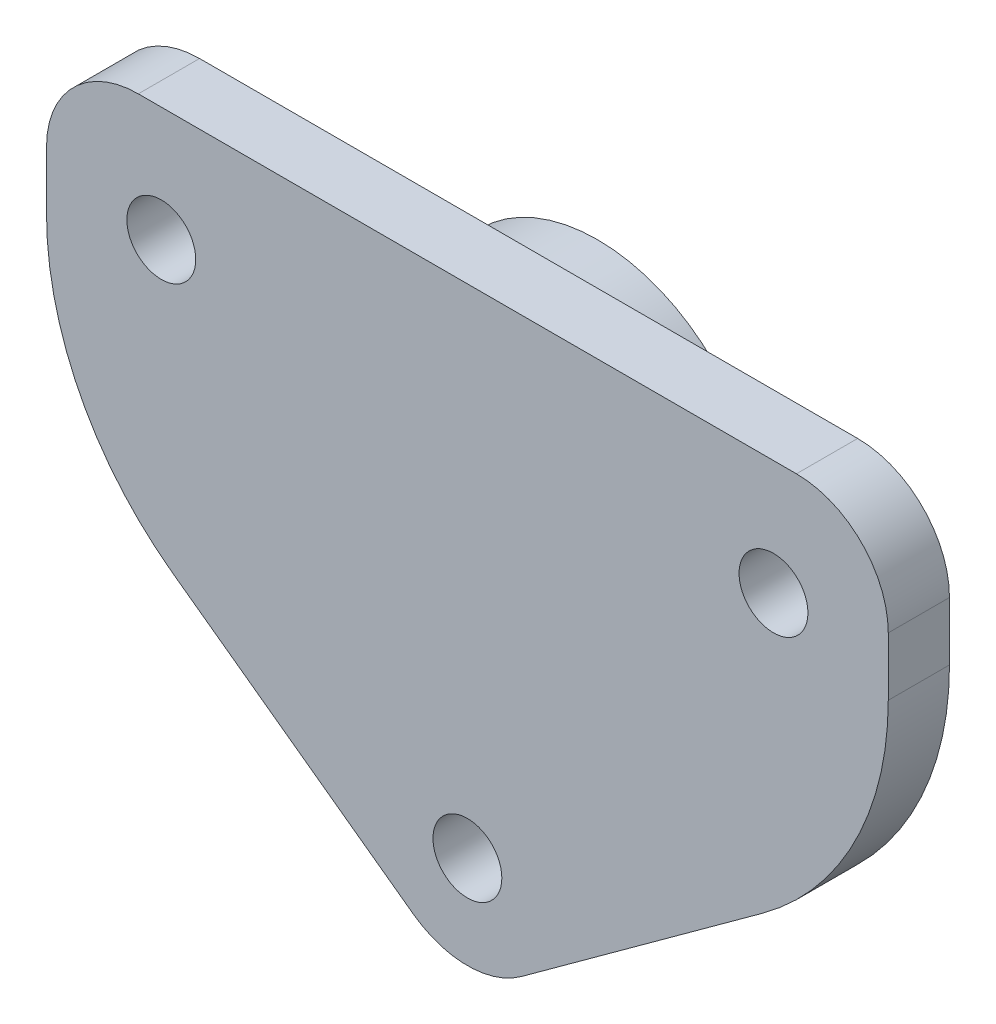
ISO-10303-21;
HEADER;
FILE_DESCRIPTION(('STEP AP214'),'2;1');
FILE_NAME('part.step','',(''),(''),'','','');
FILE_SCHEMA(('AUTOMOTIVE_DESIGN { 1 0 10303 214 1 1 1 1 }'));
ENDSEC;
DATA;
#1=APPLICATION_CONTEXT('core data for automotive mechanical design processes');
#2=APPLICATION_PROTOCOL_DEFINITION('international standard','automotive_design',2000,#1);
#3=PRODUCT_CONTEXT('',#1,'mechanical');
#4=PRODUCT('Part','Part','',(#3));
#5=PRODUCT_RELATED_PRODUCT_CATEGORY('part','',(#4));
#6=PRODUCT_DEFINITION_FORMATION('','',#4);
#7=PRODUCT_DEFINITION_CONTEXT('part definition',#1,'design');
#8=PRODUCT_DEFINITION('design','',#6,#7);
#9=PRODUCT_DEFINITION_SHAPE('','',#8);
#10=(LENGTH_UNIT() NAMED_UNIT(*) SI_UNIT(.MILLI.,.METRE.));
#11=(NAMED_UNIT(*) PLANE_ANGLE_UNIT() SI_UNIT($,.RADIAN.));
#12=(NAMED_UNIT(*) SI_UNIT($,.STERADIAN.) SOLID_ANGLE_UNIT());
#13=UNCERTAINTY_MEASURE_WITH_UNIT(LENGTH_MEASURE(1.E-05),#10,'distance_accuracy_value','');
#14=(GEOMETRIC_REPRESENTATION_CONTEXT(3) GLOBAL_UNCERTAINTY_ASSIGNED_CONTEXT((#13)) GLOBAL_UNIT_ASSIGNED_CONTEXT((#10,
#11,#12)) REPRESENTATION_CONTEXT('',''));
#15=CARTESIAN_POINT('',(0.,0.,0.));
#16=DIRECTION('',(0.,0.,1.));
#17=DIRECTION('',(1.,0.,0.));
#18=AXIS2_PLACEMENT_3D('',#15,#16,#17);
#19=CARTESIAN_POINT('',(0.,0.,4.));
#20=DIRECTION('',(0.,0.,1.));
#21=DIRECTION('',(1.,0.,0.));
#22=AXIS2_PLACEMENT_3D('',#19,#20,#21);
#23=PLANE('',#22);
#24=CARTESIAN_POINT('',(-7.5,32.5,4.));
#25=DIRECTION('',(0.,0.,1.));
#26=DIRECTION('',(1.,0.,0.));
#27=AXIS2_PLACEMENT_3D('',#24,#25,#26);
#28=CIRCLE('',#27,2.25);
#29=CARTESIAN_POINT('',(-5.25,32.5,4.));
#30=VERTEX_POINT('',#29);
#31=EDGE_CURVE('E213',#30,#30,#28,.T.);
#32=ORIENTED_EDGE('',*,*,#31,.F.);
#33=EDGE_LOOP('',(#32));
#34=FACE_BOUND('',#33,.T.);
#35=DIRECTION('',(0.,-1.,0.));
#36=VECTOR('',#35,1.);
#37=CARTESIAN_POINT('',(-55.,40.,4.));
#38=LINE('',#37,#36);
#39=CARTESIAN_POINT('',(-55.,34.,4.));
#40=VERTEX_POINT('',#39);
#41=CARTESIAN_POINT('',(-55.,30.1844918340644,4.));
#42=VERTEX_POINT('',#41);
#43=EDGE_CURVE('E144',#40,#42,#38,.T.);
#44=ORIENTED_EDGE('',*,*,#43,.T.);
#45=CARTESIAN_POINT('',(-35.,30.1844918340644,4.));
#46=DIRECTION('',(0.,0.,1.));
#47=DIRECTION('',(1.,0.,0.));
#48=AXIS2_PLACEMENT_3D('',#45,#46,#47);
#49=CIRCLE('',#48,20.);
#50=CARTESIAN_POINT('',(-46.7634339535009,14.0097701480007,4.));
#51=VERTEX_POINT('',#50);
#52=EDGE_CURVE('E176',#42,#51,#49,.T.);
#53=ORIENTED_EDGE('',*,*,#52,.T.);
#54=DIRECTION('',(0.808736084303188,-0.588171697675046,0.));
#55=VECTOR('',#54,1.);
#56=CARTESIAN_POINT('',(-55.,20.,4.));
#57=LINE('',#56,#55);
#58=CARTESIAN_POINT('',(-31.0290301860503,2.56656740803657,4.));
#59=VERTEX_POINT('',#58);
#60=EDGE_CURVE('E220',#51,#59,#57,.T.);
#61=ORIENTED_EDGE('',*,*,#60,.T.);
#62=CARTESIAN_POINT('',(-27.5,7.4189839138557,4.));
#63=DIRECTION('',(0.,0.,1.));
#64=DIRECTION('',(1.,0.,0.));
#65=AXIS2_PLACEMENT_3D('',#62,#63,#64);
#66=CIRCLE('',#65,6.);
#67=CARTESIAN_POINT('',(-23.9709698139497,2.56656740803657,4.));
#68=VERTEX_POINT('',#67);
#69=EDGE_CURVE('E154',#59,#68,#66,.T.);
#70=ORIENTED_EDGE('',*,*,#69,.T.);
#71=DIRECTION('',(0.808736084303188,0.588171697675046,0.));
#72=VECTOR('',#71,1.);
#73=CARTESIAN_POINT('',(-27.5,0.,4.));
#74=LINE('',#73,#72);
#75=CARTESIAN_POINT('',(-8.23656604649908,14.0097701480007,4.));
#76=VERTEX_POINT('',#75);
#77=EDGE_CURVE('E126',#68,#76,#74,.T.);
#78=ORIENTED_EDGE('',*,*,#77,.T.);
#79=CARTESIAN_POINT('',(-20.,30.1844918340644,4.));
#80=DIRECTION('',(0.,0.,1.));
#81=DIRECTION('',(1.,0.,0.));
#82=AXIS2_PLACEMENT_3D('',#79,#80,#81);
#83=CIRCLE('',#82,20.);
#84=CARTESIAN_POINT('',(0.,30.1844918340644,4.));
#85=VERTEX_POINT('',#84);
#86=EDGE_CURVE('E48',#76,#85,#83,.T.);
#87=ORIENTED_EDGE('',*,*,#86,.T.);
#88=DIRECTION('',(0.,1.,0.));
#89=VECTOR('',#88,1.);
#90=CARTESIAN_POINT('',(0.,40.,4.));
#91=LINE('',#90,#89);
#92=CARTESIAN_POINT('',(0.,34.,4.));
#93=VERTEX_POINT('',#92);
#94=EDGE_CURVE('E183',#85,#93,#91,.T.);
#95=ORIENTED_EDGE('',*,*,#94,.T.);
#96=CARTESIAN_POINT('',(-6.,34.,4.));
#97=DIRECTION('',(0.,0.,1.));
#98=DIRECTION('',(1.,0.,0.));
#99=AXIS2_PLACEMENT_3D('',#96,#97,#98);
#100=CIRCLE('',#99,6.);
#101=CARTESIAN_POINT('',(-6.,40.,4.));
#102=VERTEX_POINT('',#101);
#103=EDGE_CURVE('E150',#93,#102,#100,.T.);
#104=ORIENTED_EDGE('',*,*,#103,.T.);
#105=DIRECTION('',(-1.,0.,0.));
#106=VECTOR('',#105,1.);
#107=CARTESIAN_POINT('',(-55.,40.,4.));
#108=LINE('',#107,#106);
#109=CARTESIAN_POINT('',(-49.,40.,4.));
#110=VERTEX_POINT('',#109);
#111=EDGE_CURVE('E128',#102,#110,#108,.T.);
#112=ORIENTED_EDGE('',*,*,#111,.T.);
#113=CARTESIAN_POINT('',(-49.,34.,4.));
#114=DIRECTION('',(0.,0.,1.));
#115=DIRECTION('',(1.,0.,0.));
#116=AXIS2_PLACEMENT_3D('',#113,#114,#115);
#117=CIRCLE('',#116,6.);
#118=EDGE_CURVE('E152',#110,#40,#117,.T.);
#119=ORIENTED_EDGE('',*,*,#118,.T.);
#120=EDGE_LOOP('',(#44,#53,#61,#70,#78,#87,#95,#104,#112,#119));
#121=FACE_BOUND('',#120,.T.);
#122=CARTESIAN_POINT('',(-47.5,32.5,4.));
#123=DIRECTION('',(0.,0.,1.));
#124=DIRECTION('',(1.,0.,0.));
#125=AXIS2_PLACEMENT_3D('',#122,#123,#124);
#126=CIRCLE('',#125,2.25);
#127=CARTESIAN_POINT('',(-45.25,32.5,4.));
#128=VERTEX_POINT('',#127);
#129=EDGE_CURVE('E203',#128,#128,#126,.T.);
#130=ORIENTED_EDGE('',*,*,#129,.F.);
#131=EDGE_LOOP('',(#130));
#132=FACE_BOUND('',#131,.T.);
#133=CARTESIAN_POINT('',(-27.5,7.5,4.));
#134=DIRECTION('',(0.,0.,1.));
#135=DIRECTION('',(1.,0.,0.));
#136=AXIS2_PLACEMENT_3D('',#133,#134,#135);
#137=CIRCLE('',#136,2.25);
#138=CARTESIAN_POINT('',(-25.25,7.5,4.));
#139=VERTEX_POINT('',#138);
#140=EDGE_CURVE('E324',#139,#139,#137,.T.);
#141=ORIENTED_EDGE('',*,*,#140,.F.);
#142=EDGE_LOOP('',(#141));
#143=FACE_BOUND('',#142,.T.);
#144=ADVANCED_FACE('F33',(#34,#121,#132,#143),#23,.T.);
#145=CARTESIAN_POINT('',(0.,0.,0.));
#146=DIRECTION('',(0.,0.,1.));
#147=DIRECTION('',(1.,0.,0.));
#148=AXIS2_PLACEMENT_3D('',#145,#146,#147);
#149=PLANE('',#148);
#150=CARTESIAN_POINT('',(-27.5,27.5,0.));
#151=DIRECTION('',(0.,0.,1.));
#152=DIRECTION('',(1.,0.,0.));
#153=AXIS2_PLACEMENT_3D('',#150,#151,#152);
#154=CIRCLE('',#153,10.75);
#155=CARTESIAN_POINT('',(-16.75,27.5,0.));
#156=VERTEX_POINT('',#155);
#157=EDGE_CURVE('E11',#156,#156,#154,.F.);
#158=ORIENTED_EDGE('',*,*,#157,.F.);
#159=EDGE_LOOP('',(#158));
#160=FACE_BOUND('',#159,.T.);
#161=DIRECTION('',(0.808736084303188,-0.588171697675046,0.));
#162=VECTOR('',#161,1.);
#163=CARTESIAN_POINT('',(-55.,20.,0.));
#164=LINE('',#163,#162);
#165=CARTESIAN_POINT('',(-46.7634339535009,14.0097701480007,0.));
#166=VERTEX_POINT('',#165);
#167=CARTESIAN_POINT('',(-31.0290301860503,2.56656740803657,0.));
#168=VERTEX_POINT('',#167);
#169=EDGE_CURVE('E135',#166,#168,#164,.T.);
#170=ORIENTED_EDGE('',*,*,#169,.F.);
#171=CARTESIAN_POINT('',(-35.,30.1844918340644,0.));
#172=DIRECTION('',(0.,0.,1.));
#173=DIRECTION('',(1.,0.,0.));
#174=AXIS2_PLACEMENT_3D('',#171,#172,#173);
#175=CIRCLE('',#174,20.);
#176=CARTESIAN_POINT('',(-55.,30.1844918340644,0.));
#177=VERTEX_POINT('',#176);
#178=EDGE_CURVE('E171',#166,#177,#175,.F.);
#179=ORIENTED_EDGE('',*,*,#178,.T.);
#180=DIRECTION('',(0.,-1.,0.));
#181=VECTOR('',#180,1.);
#182=CARTESIAN_POINT('',(-55.,40.,0.));
#183=LINE('',#182,#181);
#184=CARTESIAN_POINT('',(-55.,34.,0.));
#185=VERTEX_POINT('',#184);
#186=EDGE_CURVE('E139',#185,#177,#183,.T.);
#187=ORIENTED_EDGE('',*,*,#186,.F.);
#188=CARTESIAN_POINT('',(-49.,34.,0.));
#189=DIRECTION('',(0.,0.,1.));
#190=DIRECTION('',(1.,0.,0.));
#191=AXIS2_PLACEMENT_3D('',#188,#189,#190);
#192=CIRCLE('',#191,6.);
#193=CARTESIAN_POINT('',(-49.,40.,0.));
#194=VERTEX_POINT('',#193);
#195=EDGE_CURVE('E122',#185,#194,#192,.F.);
#196=ORIENTED_EDGE('',*,*,#195,.T.);
#197=DIRECTION('',(-1.,0.,0.));
#198=VECTOR('',#197,1.);
#199=CARTESIAN_POINT('',(-55.,40.,0.));
#200=LINE('',#199,#198);
#201=CARTESIAN_POINT('',(-6.,40.,0.));
#202=VERTEX_POINT('',#201);
#203=EDGE_CURVE('E137',#202,#194,#200,.T.);
#204=ORIENTED_EDGE('',*,*,#203,.F.);
#205=CARTESIAN_POINT('',(-6.,34.,0.));
#206=DIRECTION('',(0.,0.,1.));
#207=DIRECTION('',(1.,0.,0.));
#208=AXIS2_PLACEMENT_3D('',#205,#206,#207);
#209=CIRCLE('',#208,6.);
#210=CARTESIAN_POINT('',(0.,34.,0.));
#211=VERTEX_POINT('',#210);
#212=EDGE_CURVE('E127',#202,#211,#209,.F.);
#213=ORIENTED_EDGE('',*,*,#212,.T.);
#214=DIRECTION('',(0.,1.,0.));
#215=VECTOR('',#214,1.);
#216=CARTESIAN_POINT('',(0.,40.,0.));
#217=LINE('',#216,#215);
#218=CARTESIAN_POINT('',(0.,30.1844918340644,0.));
#219=VERTEX_POINT('',#218);
#220=EDGE_CURVE('E134',#219,#211,#217,.T.);
#221=ORIENTED_EDGE('',*,*,#220,.F.);
#222=CARTESIAN_POINT('',(-20.,30.1844918340644,0.));
#223=DIRECTION('',(0.,0.,1.));
#224=DIRECTION('',(1.,0.,0.));
#225=AXIS2_PLACEMENT_3D('',#222,#223,#224);
#226=CIRCLE('',#225,20.);
#227=CARTESIAN_POINT('',(-8.23656604649908,14.0097701480007,0.));
#228=VERTEX_POINT('',#227);
#229=EDGE_CURVE('E133',#219,#228,#226,.F.);
#230=ORIENTED_EDGE('',*,*,#229,.T.);
#231=DIRECTION('',(0.808736084303188,0.588171697675046,0.));
#232=VECTOR('',#231,1.);
#233=CARTESIAN_POINT('',(-27.5,0.,0.));
#234=LINE('',#233,#232);
#235=CARTESIAN_POINT('',(-23.9709698139497,2.56656740803657,0.));
#236=VERTEX_POINT('',#235);
#237=EDGE_CURVE('E125',#236,#228,#234,.T.);
#238=ORIENTED_EDGE('',*,*,#237,.F.);
#239=CARTESIAN_POINT('',(-27.5,7.4189839138557,0.));
#240=DIRECTION('',(0.,0.,1.));
#241=DIRECTION('',(1.,0.,0.));
#242=AXIS2_PLACEMENT_3D('',#239,#240,#241);
#243=CIRCLE('',#242,6.);
#244=EDGE_CURVE('E112',#236,#168,#243,.F.);
#245=ORIENTED_EDGE('',*,*,#244,.T.);
#246=EDGE_LOOP('',(#170,#179,#187,#196,#204,#213,#221,#230,#238,#245));
#247=FACE_BOUND('',#246,.T.);
#248=CARTESIAN_POINT('',(-47.5,32.5,0.));
#249=DIRECTION('',(0.,0.,1.));
#250=DIRECTION('',(1.,0.,0.));
#251=AXIS2_PLACEMENT_3D('',#248,#249,#250);
#252=CIRCLE('',#251,2.25);
#253=CARTESIAN_POINT('',(-45.25,32.5,0.));
#254=VERTEX_POINT('',#253);
#255=EDGE_CURVE('E208',#254,#254,#252,.T.);
#256=ORIENTED_EDGE('',*,*,#255,.T.);
#257=EDGE_LOOP('',(#256));
#258=FACE_BOUND('',#257,.T.);
#259=CARTESIAN_POINT('',(-7.5,32.5,0.));
#260=DIRECTION('',(0.,0.,1.));
#261=DIRECTION('',(1.,0.,0.));
#262=AXIS2_PLACEMENT_3D('',#259,#260,#261);
#263=CIRCLE('',#262,2.25);
#264=CARTESIAN_POINT('',(-5.25,32.5,0.));
#265=VERTEX_POINT('',#264);
#266=EDGE_CURVE('E216',#265,#265,#263,.T.);
#267=ORIENTED_EDGE('',*,*,#266,.T.);
#268=EDGE_LOOP('',(#267));
#269=FACE_BOUND('',#268,.T.);
#270=CARTESIAN_POINT('',(-27.5,7.5,0.));
#271=DIRECTION('',(0.,0.,1.));
#272=DIRECTION('',(1.,0.,0.));
#273=AXIS2_PLACEMENT_3D('',#270,#271,#272);
#274=CIRCLE('',#273,2.25);
#275=CARTESIAN_POINT('',(-25.25,7.5,0.));
#276=VERTEX_POINT('',#275);
#277=EDGE_CURVE('E326',#276,#276,#274,.T.);
#278=ORIENTED_EDGE('',*,*,#277,.T.);
#279=EDGE_LOOP('',(#278));
#280=FACE_BOUND('',#279,.T.);
#281=ADVANCED_FACE('F130',(#160,#247,#258,#269,#280),#149,.F.);
#282=CARTESIAN_POINT('',(-55.,40.,4.));
#283=DIRECTION('',(1.,0.,0.));
#284=DIRECTION('',(0.,1.,0.));
#285=AXIS2_PLACEMENT_3D('',#282,#283,#284);
#286=PLANE('',#285);
#287=ORIENTED_EDGE('',*,*,#186,.T.);
#288=DIRECTION('',(0.,0.,-1.));
#289=VECTOR('',#288,1.);
#290=CARTESIAN_POINT('',(-55.,30.1844918340644,4.));
#291=LINE('',#290,#289);
#292=EDGE_CURVE('E173',#177,#42,#291,.F.);
#293=ORIENTED_EDGE('',*,*,#292,.T.);
#294=ORIENTED_EDGE('',*,*,#43,.F.);
#295=DIRECTION('',(0.,0.,-1.));
#296=VECTOR('',#295,1.);
#297=CARTESIAN_POINT('',(-55.,34.,4.));
#298=LINE('',#297,#296);
#299=EDGE_CURVE('E156',#40,#185,#298,.T.);
#300=ORIENTED_EDGE('',*,*,#299,.T.);
#301=EDGE_LOOP('',(#287,#293,#294,#300));
#302=FACE_BOUND('',#301,.T.);
#303=ADVANCED_FACE('F238',(#302),#286,.F.);
#304=CARTESIAN_POINT('',(-55.,20.,4.));
#305=DIRECTION('',(0.588171697675046,0.808736084303189,0.));
#306=DIRECTION('',(-0.808736084303189,0.588171697675046,0.));
#307=AXIS2_PLACEMENT_3D('',#304,#305,#306);
#308=PLANE('',#307);
#309=ORIENTED_EDGE('',*,*,#60,.F.);
#310=DIRECTION('',(0.,0.,-1.));
#311=VECTOR('',#310,1.);
#312=CARTESIAN_POINT('',(-46.7634339535009,14.0097701480007,4.));
#313=LINE('',#312,#311);
#314=EDGE_CURVE('E167',#51,#166,#313,.T.);
#315=ORIENTED_EDGE('',*,*,#314,.T.);
#316=ORIENTED_EDGE('',*,*,#169,.T.);
#317=DIRECTION('',(0.,0.,-1.));
#318=VECTOR('',#317,1.);
#319=CARTESIAN_POINT('',(-31.0290301860503,2.56656740803657,4.));
#320=LINE('',#319,#318);
#321=EDGE_CURVE('E118',#168,#59,#320,.F.);
#322=ORIENTED_EDGE('',*,*,#321,.T.);
#323=EDGE_LOOP('',(#309,#315,#316,#322));
#324=FACE_BOUND('',#323,.T.);
#325=ADVANCED_FACE('F252',(#324),#308,.F.);
#326=CARTESIAN_POINT('',(-27.5,0.,4.));
#327=DIRECTION('',(-0.588171697675046,0.808736084303189,0.));
#328=DIRECTION('',(-0.808736084303189,-0.588171697675046,0.));
#329=AXIS2_PLACEMENT_3D('',#326,#327,#328);
#330=PLANE('',#329);
#331=ORIENTED_EDGE('',*,*,#237,.T.);
#332=DIRECTION('',(0.,0.,-1.));
#333=VECTOR('',#332,1.);
#334=CARTESIAN_POINT('',(-8.23656604649908,14.0097701480007,4.));
#335=LINE('',#334,#333);
#336=EDGE_CURVE('E41',#228,#76,#335,.F.);
#337=ORIENTED_EDGE('',*,*,#336,.T.);
#338=ORIENTED_EDGE('',*,*,#77,.F.);
#339=DIRECTION('',(0.,0.,-1.));
#340=VECTOR('',#339,1.);
#341=CARTESIAN_POINT('',(-23.9709698139497,2.56656740803657,4.));
#342=LINE('',#341,#340);
#343=EDGE_CURVE('E116',#68,#236,#342,.T.);
#344=ORIENTED_EDGE('',*,*,#343,.T.);
#345=EDGE_LOOP('',(#331,#337,#338,#344));
#346=FACE_BOUND('',#345,.T.);
#347=ADVANCED_FACE('F124',(#346),#330,.F.);
#348=CARTESIAN_POINT('',(0.,40.,4.));
#349=DIRECTION('',(-1.,0.,0.));
#350=DIRECTION('',(0.,0.,1.));
#351=AXIS2_PLACEMENT_3D('',#348,#349,#350);
#352=PLANE('',#351);
#353=ORIENTED_EDGE('',*,*,#94,.F.);
#354=DIRECTION('',(0.,0.,-1.));
#355=VECTOR('',#354,1.);
#356=CARTESIAN_POINT('',(0.,30.1844918340644,4.));
#357=LINE('',#356,#355);
#358=EDGE_CURVE('E178',#85,#219,#357,.T.);
#359=ORIENTED_EDGE('',*,*,#358,.T.);
#360=ORIENTED_EDGE('',*,*,#220,.T.);
#361=DIRECTION('',(0.,0.,-1.));
#362=VECTOR('',#361,1.);
#363=CARTESIAN_POINT('',(0.,34.,4.));
#364=LINE('',#363,#362);
#365=EDGE_CURVE('E164',#211,#93,#364,.F.);
#366=ORIENTED_EDGE('',*,*,#365,.T.);
#367=EDGE_LOOP('',(#353,#359,#360,#366));
#368=FACE_BOUND('',#367,.T.);
#369=ADVANCED_FACE('F182',(#368),#352,.F.);
#370=CARTESIAN_POINT('',(-55.,40.,4.));
#371=DIRECTION('',(0.,-1.,0.));
#372=DIRECTION('',(0.,0.,-1.));
#373=AXIS2_PLACEMENT_3D('',#370,#371,#372);
#374=PLANE('',#373);
#375=ORIENTED_EDGE('',*,*,#203,.T.);
#376=DIRECTION('',(0.,0.,-1.));
#377=VECTOR('',#376,1.);
#378=CARTESIAN_POINT('',(-49.,40.,4.));
#379=LINE('',#378,#377);
#380=EDGE_CURVE('E162',#194,#110,#379,.F.);
#381=ORIENTED_EDGE('',*,*,#380,.T.);
#382=ORIENTED_EDGE('',*,*,#111,.F.);
#383=DIRECTION('',(0.,0.,-1.));
#384=VECTOR('',#383,1.);
#385=CARTESIAN_POINT('',(-6.,40.,4.));
#386=LINE('',#385,#384);
#387=EDGE_CURVE('E159',#102,#202,#386,.T.);
#388=ORIENTED_EDGE('',*,*,#387,.T.);
#389=EDGE_LOOP('',(#375,#381,#382,#388));
#390=FACE_BOUND('',#389,.T.);
#391=ADVANCED_FACE('F197',(#390),#374,.F.);
#392=CARTESIAN_POINT('',(-47.5,32.5,4.));
#393=DIRECTION('',(0.,0.,-1.));
#394=DIRECTION('',(-1.,0.,0.));
#395=AXIS2_PLACEMENT_3D('',#392,#393,#394);
#396=CYLINDRICAL_SURFACE('',#395,2.25);
#397=ORIENTED_EDGE('',*,*,#129,.T.);
#398=EDGE_LOOP('',(#397));
#399=FACE_BOUND('',#398,.T.);
#400=ORIENTED_EDGE('',*,*,#255,.F.);
#401=EDGE_LOOP('',(#400));
#402=FACE_BOUND('',#401,.T.);
#403=ADVANCED_FACE('F243',(#399,#402),#396,.F.);
#404=CARTESIAN_POINT('',(-7.5,32.5,4.));
#405=DIRECTION('',(0.,0.,-1.));
#406=DIRECTION('',(-1.,0.,0.));
#407=AXIS2_PLACEMENT_3D('',#404,#405,#406);
#408=CYLINDRICAL_SURFACE('',#407,2.25);
#409=ORIENTED_EDGE('',*,*,#31,.T.);
#410=EDGE_LOOP('',(#409));
#411=FACE_BOUND('',#410,.T.);
#412=ORIENTED_EDGE('',*,*,#266,.F.);
#413=EDGE_LOOP('',(#412));
#414=FACE_BOUND('',#413,.T.);
#415=ADVANCED_FACE('F312',(#411,#414),#408,.F.);
#416=CARTESIAN_POINT('',(-27.5,7.5,4.));
#417=DIRECTION('',(0.,0.,-1.));
#418=DIRECTION('',(-1.,0.,0.));
#419=AXIS2_PLACEMENT_3D('',#416,#417,#418);
#420=CYLINDRICAL_SURFACE('',#419,2.25);
#421=ORIENTED_EDGE('',*,*,#140,.T.);
#422=EDGE_LOOP('',(#421));
#423=FACE_BOUND('',#422,.T.);
#424=ORIENTED_EDGE('',*,*,#277,.F.);
#425=EDGE_LOOP('',(#424));
#426=FACE_BOUND('',#425,.T.);
#427=ADVANCED_FACE('F261',(#423,#426),#420,.F.);
#428=CARTESIAN_POINT('',(-27.5,7.4189839138557,4.));
#429=DIRECTION('',(0.,0.,-1.));
#430=DIRECTION('',(-1.,0.,0.));
#431=AXIS2_PLACEMENT_3D('',#428,#429,#430);
#432=CYLINDRICAL_SURFACE('',#431,6.);
#433=ORIENTED_EDGE('',*,*,#69,.F.);
#434=ORIENTED_EDGE('',*,*,#321,.F.);
#435=ORIENTED_EDGE('',*,*,#244,.F.);
#436=ORIENTED_EDGE('',*,*,#343,.F.);
#437=EDGE_LOOP('',(#433,#434,#435,#436));
#438=FACE_BOUND('',#437,.T.);
#439=ADVANCED_FACE('F115',(#438),#432,.T.);
#440=CARTESIAN_POINT('',(-49.,34.,4.));
#441=DIRECTION('',(0.,0.,-1.));
#442=DIRECTION('',(-1.,0.,0.));
#443=AXIS2_PLACEMENT_3D('',#440,#441,#442);
#444=CYLINDRICAL_SURFACE('',#443,6.);
#445=ORIENTED_EDGE('',*,*,#118,.F.);
#446=ORIENTED_EDGE('',*,*,#380,.F.);
#447=ORIENTED_EDGE('',*,*,#195,.F.);
#448=ORIENTED_EDGE('',*,*,#299,.F.);
#449=EDGE_LOOP('',(#445,#446,#447,#448));
#450=FACE_BOUND('',#449,.T.);
#451=ADVANCED_FACE('F260',(#450),#444,.T.);
#452=CARTESIAN_POINT('',(-6.,34.,4.));
#453=DIRECTION('',(0.,0.,-1.));
#454=DIRECTION('',(-1.,0.,0.));
#455=AXIS2_PLACEMENT_3D('',#452,#453,#454);
#456=CYLINDRICAL_SURFACE('',#455,6.);
#457=ORIENTED_EDGE('',*,*,#103,.F.);
#458=ORIENTED_EDGE('',*,*,#365,.F.);
#459=ORIENTED_EDGE('',*,*,#212,.F.);
#460=ORIENTED_EDGE('',*,*,#387,.F.);
#461=EDGE_LOOP('',(#457,#458,#459,#460));
#462=FACE_BOUND('',#461,.T.);
#463=ADVANCED_FACE('F190',(#462),#456,.T.);
#464=CARTESIAN_POINT('',(-35.,30.1844918340644,4.));
#465=DIRECTION('',(0.,0.,-1.));
#466=DIRECTION('',(-1.,0.,0.));
#467=AXIS2_PLACEMENT_3D('',#464,#465,#466);
#468=CYLINDRICAL_SURFACE('',#467,20.);
#469=ORIENTED_EDGE('',*,*,#52,.F.);
#470=ORIENTED_EDGE('',*,*,#292,.F.);
#471=ORIENTED_EDGE('',*,*,#178,.F.);
#472=ORIENTED_EDGE('',*,*,#314,.F.);
#473=EDGE_LOOP('',(#469,#470,#471,#472));
#474=FACE_BOUND('',#473,.T.);
#475=ADVANCED_FACE('F223',(#474),#468,.T.);
#476=CARTESIAN_POINT('',(-20.,30.1844918340644,4.));
#477=DIRECTION('',(0.,0.,-1.));
#478=DIRECTION('',(-1.,0.,0.));
#479=AXIS2_PLACEMENT_3D('',#476,#477,#478);
#480=CYLINDRICAL_SURFACE('',#479,20.);
#481=ORIENTED_EDGE('',*,*,#86,.F.);
#482=ORIENTED_EDGE('',*,*,#336,.F.);
#483=ORIENTED_EDGE('',*,*,#229,.F.);
#484=ORIENTED_EDGE('',*,*,#358,.F.);
#485=EDGE_LOOP('',(#481,#482,#483,#484));
#486=FACE_BOUND('',#485,.T.);
#487=ADVANCED_FACE('F35',(#486),#480,.T.);
#488=CARTESIAN_POINT('',(-27.5,27.5,-4.5));
#489=DIRECTION('',(0.,0.,1.));
#490=DIRECTION('',(1.,0.,0.));
#491=AXIS2_PLACEMENT_3D('',#488,#489,#490);
#492=CYLINDRICAL_SURFACE('',#491,10.75);
#493=CARTESIAN_POINT('',(-27.5,27.5,-4.5));
#494=DIRECTION('',(0.,0.,-1.));
#495=DIRECTION('',(-1.,0.,0.));
#496=AXIS2_PLACEMENT_3D('',#493,#494,#495);
#497=CIRCLE('',#496,10.75);
#498=CARTESIAN_POINT('',(-38.25,27.5,-4.5));
#499=VERTEX_POINT('',#498);
#500=EDGE_CURVE('E330',#499,#499,#497,.T.);
#501=ORIENTED_EDGE('',*,*,#500,.F.);
#502=EDGE_LOOP('',(#501));
#503=FACE_BOUND('',#502,.T.);
#504=ORIENTED_EDGE('',*,*,#157,.T.);
#505=EDGE_LOOP('',(#504));
#506=FACE_BOUND('',#505,.T.);
#507=ADVANCED_FACE('F222',(#503,#506),#492,.T.);
#508=CARTESIAN_POINT('',(-27.5,27.5,-4.5));
#509=DIRECTION('',(0.,0.,-1.));
#510=DIRECTION('',(-1.,0.,0.));
#511=AXIS2_PLACEMENT_3D('',#508,#509,#510);
#512=PLANE('',#511);
#513=ORIENTED_EDGE('',*,*,#500,.T.);
#514=EDGE_LOOP('',(#513));
#515=FACE_BOUND('',#514,.T.);
#516=ADVANCED_FACE('F228',(#515),#512,.T.);
#517=CLOSED_SHELL('',(#144,#281,#303,#325,#347,#369,#391,#403,#415,#427,#439,#451,#463,#475,
#487,#507,#516));
#518=MANIFOLD_SOLID_BREP('B2',#517);
#519=ADVANCED_BREP_SHAPE_REPRESENTATION('',(#18,#518),#14);
#520=SHAPE_DEFINITION_REPRESENTATION(#9,#519);
ENDSEC;
END-ISO-10303-21;
